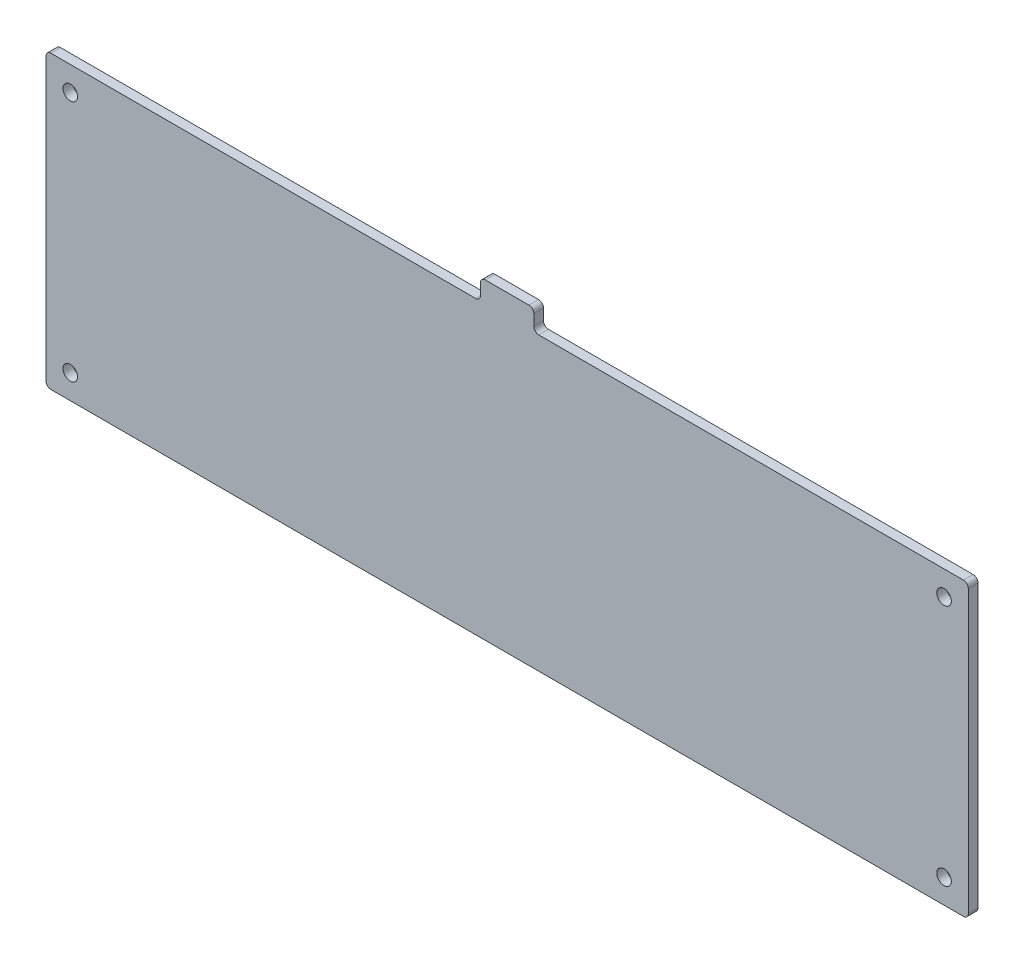
ISO-10303-21;
HEADER;
FILE_DESCRIPTION(('STEP AP214'),'2;1');
FILE_NAME('part.step','',(''),(''),'','','');
FILE_SCHEMA(('AUTOMOTIVE_DESIGN { 1 0 10303 214 1 1 1 1 }'));
ENDSEC;
DATA;
#1=APPLICATION_CONTEXT('core data for automotive mechanical design processes');
#2=APPLICATION_PROTOCOL_DEFINITION('international standard','automotive_design',2000,#1);
#3=PRODUCT_CONTEXT('',#1,'mechanical');
#4=PRODUCT('Part','Part','',(#3));
#5=PRODUCT_RELATED_PRODUCT_CATEGORY('part','',(#4));
#6=PRODUCT_DEFINITION_FORMATION('','',#4);
#7=PRODUCT_DEFINITION_CONTEXT('part definition',#1,'design');
#8=PRODUCT_DEFINITION('design','',#6,#7);
#9=PRODUCT_DEFINITION_SHAPE('','',#8);
#10=(LENGTH_UNIT() NAMED_UNIT(*) SI_UNIT(.MILLI.,.METRE.));
#11=(NAMED_UNIT(*) PLANE_ANGLE_UNIT() SI_UNIT($,.RADIAN.));
#12=(NAMED_UNIT(*) SI_UNIT($,.STERADIAN.) SOLID_ANGLE_UNIT());
#13=UNCERTAINTY_MEASURE_WITH_UNIT(LENGTH_MEASURE(1.E-05),#10,'distance_accuracy_value','');
#14=(GEOMETRIC_REPRESENTATION_CONTEXT(3) GLOBAL_UNCERTAINTY_ASSIGNED_CONTEXT((#13)) GLOBAL_UNIT_ASSIGNED_CONTEXT((#10,
#11,#12)) REPRESENTATION_CONTEXT('',''));
#15=CARTESIAN_POINT('',(0.,0.,0.));
#16=DIRECTION('',(0.,0.,1.));
#17=DIRECTION('',(1.,0.,0.));
#18=AXIS2_PLACEMENT_3D('',#15,#16,#17);
#19=CARTESIAN_POINT('',(0.,0.,2.));
#20=DIRECTION('',(0.,0.,1.));
#21=DIRECTION('',(1.,0.,0.));
#22=AXIS2_PLACEMENT_3D('',#19,#20,#21);
#23=PLANE('',#22);
#24=CARTESIAN_POINT('',(-25.,-8.5,2.));
#25=DIRECTION('',(0.,0.,1.));
#26=DIRECTION('',(-1.,0.,0.));
#27=AXIS2_PLACEMENT_3D('',#24,#25,#26);
#28=CIRCLE('',#27,1.5);
#29=CARTESIAN_POINT('',(-26.5,-8.5,2.));
#30=VERTEX_POINT('',#29);
#31=EDGE_CURVE('E529',#30,#30,#28,.T.);
#32=ORIENTED_EDGE('',*,*,#31,.F.);
#33=EDGE_LOOP('',(#32));
#34=FACE_BOUND('',#33,.T.);
#35=CARTESIAN_POINT('',(-25.,41.5,2.));
#36=DIRECTION('',(0.,0.,1.));
#37=DIRECTION('',(1.,0.,0.));
#38=AXIS2_PLACEMENT_3D('',#35,#36,#37);
#39=CIRCLE('',#38,1.5);
#40=CARTESIAN_POINT('',(-23.5,41.5,2.));
#41=VERTEX_POINT('',#40);
#42=EDGE_CURVE('E182',#41,#41,#39,.T.);
#43=ORIENTED_EDGE('',*,*,#42,.F.);
#44=EDGE_LOOP('',(#43));
#45=FACE_BOUND('',#44,.T.);
#46=DIRECTION('',(-1.,0.,0.));
#47=VECTOR('',#46,1.);
#48=CARTESIAN_POINT('',(59.5,46.5,2.));
#49=LINE('',#48,#47);
#50=CARTESIAN_POINT('',(58.5,46.5,2.));
#51=VERTEX_POINT('',#50);
#52=CARTESIAN_POINT('',(-29.,46.5,2.));
#53=VERTEX_POINT('',#52);
#54=EDGE_CURVE('E199',#51,#53,#49,.T.);
#55=ORIENTED_EDGE('',*,*,#54,.T.);
#56=CARTESIAN_POINT('',(-29.,45.5,2.));
#57=DIRECTION('',(0.,0.,1.));
#58=DIRECTION('',(1.,0.,0.));
#59=AXIS2_PLACEMENT_3D('',#56,#57,#58);
#60=CIRCLE('',#59,1.);
#61=CARTESIAN_POINT('',(-30.,45.5,2.));
#62=VERTEX_POINT('',#61);
#63=EDGE_CURVE('E222',#53,#62,#60,.T.);
#64=ORIENTED_EDGE('',*,*,#63,.T.);
#65=DIRECTION('',(0.,-1.,0.));
#66=VECTOR('',#65,1.);
#67=CARTESIAN_POINT('',(-30.,46.5,2.));
#68=LINE('',#67,#66);
#69=CARTESIAN_POINT('',(-30.,-12.5,2.));
#70=VERTEX_POINT('',#69);
#71=EDGE_CURVE('E169',#62,#70,#68,.T.);
#72=ORIENTED_EDGE('',*,*,#71,.T.);
#73=CARTESIAN_POINT('',(-29.,-12.5,2.));
#74=DIRECTION('',(0.,0.,1.));
#75=DIRECTION('',(1.,0.,0.));
#76=AXIS2_PLACEMENT_3D('',#73,#74,#75);
#77=CIRCLE('',#76,1.);
#78=CARTESIAN_POINT('',(-29.,-13.5,2.));
#79=VERTEX_POINT('',#78);
#80=EDGE_CURVE('E220',#70,#79,#77,.T.);
#81=ORIENTED_EDGE('',*,*,#80,.T.);
#82=DIRECTION('',(1.,0.,0.));
#83=VECTOR('',#82,1.);
#84=CARTESIAN_POINT('',(-30.,-13.5,2.));
#85=LINE('',#84,#83);
#86=CARTESIAN_POINT('',(159.,-13.5,2.));
#87=VERTEX_POINT('',#86);
#88=EDGE_CURVE('E269',#79,#87,#85,.T.);
#89=ORIENTED_EDGE('',*,*,#88,.T.);
#90=CARTESIAN_POINT('',(159.,-12.5,2.));
#91=DIRECTION('',(0.,0.,1.));
#92=DIRECTION('',(1.,0.,0.));
#93=AXIS2_PLACEMENT_3D('',#90,#91,#92);
#94=CIRCLE('',#93,1.);
#95=CARTESIAN_POINT('',(160.,-12.5,2.));
#96=VERTEX_POINT('',#95);
#97=EDGE_CURVE('E218',#87,#96,#94,.T.);
#98=ORIENTED_EDGE('',*,*,#97,.T.);
#99=DIRECTION('',(0.,1.,0.));
#100=VECTOR('',#99,1.);
#101=CARTESIAN_POINT('',(160.,46.5,2.));
#102=LINE('',#101,#100);
#103=CARTESIAN_POINT('',(160.,45.5,2.));
#104=VERTEX_POINT('',#103);
#105=EDGE_CURVE('E277',#96,#104,#102,.T.);
#106=ORIENTED_EDGE('',*,*,#105,.T.);
#107=CARTESIAN_POINT('',(159.,45.5,2.));
#108=DIRECTION('',(0.,0.,1.));
#109=DIRECTION('',(1.,0.,0.));
#110=AXIS2_PLACEMENT_3D('',#107,#108,#109);
#111=CIRCLE('',#110,1.);
#112=CARTESIAN_POINT('',(159.,46.5,2.));
#113=VERTEX_POINT('',#112);
#114=EDGE_CURVE('E216',#104,#113,#111,.T.);
#115=ORIENTED_EDGE('',*,*,#114,.T.);
#116=DIRECTION('',(-1.,0.,0.));
#117=VECTOR('',#116,1.);
#118=CARTESIAN_POINT('',(160.,46.5,2.));
#119=LINE('',#118,#117);
#120=CARTESIAN_POINT('',(71.5,46.5,2.));
#121=VERTEX_POINT('',#120);
#122=EDGE_CURVE('E280',#113,#121,#119,.T.);
#123=ORIENTED_EDGE('',*,*,#122,.T.);
#124=CARTESIAN_POINT('',(71.5,47.5,2.));
#125=DIRECTION('',(0.,0.,1.));
#126=DIRECTION('',(1.,0.,0.));
#127=AXIS2_PLACEMENT_3D('',#124,#125,#126);
#128=CIRCLE('',#127,1.);
#129=CARTESIAN_POINT('',(70.5,47.5,2.));
#130=VERTEX_POINT('',#129);
#131=EDGE_CURVE('E255',#121,#130,#128,.F.);
#132=ORIENTED_EDGE('',*,*,#131,.T.);
#133=DIRECTION('',(0.,1.,0.));
#134=VECTOR('',#133,1.);
#135=CARTESIAN_POINT('',(70.5,50.8,2.));
#136=LINE('',#135,#134);
#137=CARTESIAN_POINT('',(70.5,49.8,2.));
#138=VERTEX_POINT('',#137);
#139=EDGE_CURVE('E283',#130,#138,#136,.T.);
#140=ORIENTED_EDGE('',*,*,#139,.T.);
#141=CARTESIAN_POINT('',(69.5,49.8,2.));
#142=DIRECTION('',(0.,0.,1.));
#143=DIRECTION('',(1.,0.,0.));
#144=AXIS2_PLACEMENT_3D('',#141,#142,#143);
#145=CIRCLE('',#144,1.);
#146=CARTESIAN_POINT('',(69.5,50.8,2.));
#147=VERTEX_POINT('',#146);
#148=EDGE_CURVE('E214',#138,#147,#145,.T.);
#149=ORIENTED_EDGE('',*,*,#148,.T.);
#150=DIRECTION('',(-1.,0.,0.));
#151=VECTOR('',#150,1.);
#152=CARTESIAN_POINT('',(59.5,50.8,2.));
#153=LINE('',#152,#151);
#154=CARTESIAN_POINT('',(60.5,50.8,2.));
#155=VERTEX_POINT('',#154);
#156=EDGE_CURVE('E286',#147,#155,#153,.T.);
#157=ORIENTED_EDGE('',*,*,#156,.T.);
#158=CARTESIAN_POINT('',(60.5,49.8,2.));
#159=DIRECTION('',(0.,0.,1.));
#160=DIRECTION('',(1.,0.,0.));
#161=AXIS2_PLACEMENT_3D('',#158,#159,#160);
#162=CIRCLE('',#161,1.);
#163=CARTESIAN_POINT('',(59.5,49.8,2.));
#164=VERTEX_POINT('',#163);
#165=EDGE_CURVE('E57',#155,#164,#162,.T.);
#166=ORIENTED_EDGE('',*,*,#165,.T.);
#167=DIRECTION('',(0.,-1.,0.));
#168=VECTOR('',#167,1.);
#169=CARTESIAN_POINT('',(59.5,46.5,2.));
#170=LINE('',#169,#168);
#171=CARTESIAN_POINT('',(59.5,47.5,2.));
#172=VERTEX_POINT('',#171);
#173=EDGE_CURVE('E200',#164,#172,#170,.T.);
#174=ORIENTED_EDGE('',*,*,#173,.T.);
#175=CARTESIAN_POINT('',(58.5,47.5,2.));
#176=DIRECTION('',(0.,0.,1.));
#177=DIRECTION('',(1.,0.,0.));
#178=AXIS2_PLACEMENT_3D('',#175,#176,#177);
#179=CIRCLE('',#178,1.);
#180=EDGE_CURVE('E11',#172,#51,#179,.F.);
#181=ORIENTED_EDGE('',*,*,#180,.T.);
#182=EDGE_LOOP('',(#55,#64,#72,#81,#89,#98,#106,#115,#123,#132,#140,#149,#157,#166,#174,#181));
#183=FACE_BOUND('',#182,.T.);
#184=CARTESIAN_POINT('',(155.,41.5,2.));
#185=DIRECTION('',(0.,0.,1.));
#186=DIRECTION('',(-1.,0.,0.));
#187=AXIS2_PLACEMENT_3D('',#184,#185,#186);
#188=CIRCLE('',#187,1.5);
#189=CARTESIAN_POINT('',(153.5,41.5,2.));
#190=VERTEX_POINT('',#189);
#191=EDGE_CURVE('E535',#190,#190,#188,.T.);
#192=ORIENTED_EDGE('',*,*,#191,.F.);
#193=EDGE_LOOP('',(#192));
#194=FACE_BOUND('',#193,.T.);
#195=CARTESIAN_POINT('',(155.,-8.49999999999997,2.));
#196=DIRECTION('',(0.,0.,1.));
#197=DIRECTION('',(1.,0.,0.));
#198=AXIS2_PLACEMENT_3D('',#195,#196,#197);
#199=CIRCLE('',#198,1.5);
#200=CARTESIAN_POINT('',(156.5,-8.49999999999997,2.));
#201=VERTEX_POINT('',#200);
#202=EDGE_CURVE('E520',#201,#201,#199,.T.);
#203=ORIENTED_EDGE('',*,*,#202,.F.);
#204=EDGE_LOOP('',(#203));
#205=FACE_BOUND('',#204,.T.);
#206=ADVANCED_FACE('F35',(#34,#45,#183,#194,#205),#23,.T.);
#207=CARTESIAN_POINT('',(0.,0.,0.));
#208=DIRECTION('',(0.,0.,1.));
#209=DIRECTION('',(1.,0.,0.));
#210=AXIS2_PLACEMENT_3D('',#207,#208,#209);
#211=PLANE('',#210);
#212=DIRECTION('',(0.,-1.,0.));
#213=VECTOR('',#212,1.);
#214=CARTESIAN_POINT('',(-30.,46.5,0.));
#215=LINE('',#214,#213);
#216=CARTESIAN_POINT('',(-30.,45.5,0.));
#217=VERTEX_POINT('',#216);
#218=CARTESIAN_POINT('',(-30.,-12.5,0.));
#219=VERTEX_POINT('',#218);
#220=EDGE_CURVE('E166',#217,#219,#215,.T.);
#221=ORIENTED_EDGE('',*,*,#220,.F.);
#222=CARTESIAN_POINT('',(-29.,45.5,0.));
#223=DIRECTION('',(0.,0.,1.));
#224=DIRECTION('',(1.,0.,0.));
#225=AXIS2_PLACEMENT_3D('',#222,#223,#224);
#226=CIRCLE('',#225,1.);
#227=CARTESIAN_POINT('',(-29.,46.5,0.));
#228=VERTEX_POINT('',#227);
#229=EDGE_CURVE('E149',#217,#228,#226,.F.);
#230=ORIENTED_EDGE('',*,*,#229,.T.);
#231=DIRECTION('',(-1.,0.,0.));
#232=VECTOR('',#231,1.);
#233=CARTESIAN_POINT('',(59.5,46.5,0.));
#234=LINE('',#233,#232);
#235=CARTESIAN_POINT('',(58.5,46.5,0.));
#236=VERTEX_POINT('',#235);
#237=EDGE_CURVE('E177',#236,#228,#234,.T.);
#238=ORIENTED_EDGE('',*,*,#237,.F.);
#239=CARTESIAN_POINT('',(58.5,47.5,0.));
#240=DIRECTION('',(0.,0.,1.));
#241=DIRECTION('',(1.,0.,0.));
#242=AXIS2_PLACEMENT_3D('',#239,#240,#241);
#243=CIRCLE('',#242,1.);
#244=CARTESIAN_POINT('',(59.5,47.5,0.));
#245=VERTEX_POINT('',#244);
#246=EDGE_CURVE('E43',#236,#245,#243,.T.);
#247=ORIENTED_EDGE('',*,*,#246,.T.);
#248=DIRECTION('',(0.,-1.,0.));
#249=VECTOR('',#248,1.);
#250=CARTESIAN_POINT('',(59.5,46.5,0.));
#251=LINE('',#250,#249);
#252=CARTESIAN_POINT('',(59.5,49.8,0.));
#253=VERTEX_POINT('',#252);
#254=EDGE_CURVE('E197',#253,#245,#251,.T.);
#255=ORIENTED_EDGE('',*,*,#254,.F.);
#256=CARTESIAN_POINT('',(60.5,49.8,0.));
#257=DIRECTION('',(0.,0.,1.));
#258=DIRECTION('',(1.,0.,0.));
#259=AXIS2_PLACEMENT_3D('',#256,#257,#258);
#260=CIRCLE('',#259,1.);
#261=CARTESIAN_POINT('',(60.5,50.8,0.));
#262=VERTEX_POINT('',#261);
#263=EDGE_CURVE('E170',#253,#262,#260,.F.);
#264=ORIENTED_EDGE('',*,*,#263,.T.);
#265=DIRECTION('',(-1.,0.,0.));
#266=VECTOR('',#265,1.);
#267=CARTESIAN_POINT('',(59.5,50.8,0.));
#268=LINE('',#267,#266);
#269=CARTESIAN_POINT('',(69.5,50.8,0.));
#270=VERTEX_POINT('',#269);
#271=EDGE_CURVE('E194',#270,#262,#268,.T.);
#272=ORIENTED_EDGE('',*,*,#271,.F.);
#273=CARTESIAN_POINT('',(69.5,49.8,0.));
#274=DIRECTION('',(0.,0.,1.));
#275=DIRECTION('',(1.,0.,0.));
#276=AXIS2_PLACEMENT_3D('',#273,#274,#275);
#277=CIRCLE('',#276,1.);
#278=CARTESIAN_POINT('',(70.5,49.8,0.));
#279=VERTEX_POINT('',#278);
#280=EDGE_CURVE('E203',#270,#279,#277,.F.);
#281=ORIENTED_EDGE('',*,*,#280,.T.);
#282=DIRECTION('',(0.,1.,0.));
#283=VECTOR('',#282,1.);
#284=CARTESIAN_POINT('',(70.5,50.8,0.));
#285=LINE('',#284,#283);
#286=CARTESIAN_POINT('',(70.5,47.5,0.));
#287=VERTEX_POINT('',#286);
#288=EDGE_CURVE('E191',#287,#279,#285,.T.);
#289=ORIENTED_EDGE('',*,*,#288,.F.);
#290=CARTESIAN_POINT('',(71.5,47.5,0.));
#291=DIRECTION('',(0.,0.,1.));
#292=DIRECTION('',(1.,0.,0.));
#293=AXIS2_PLACEMENT_3D('',#290,#291,#292);
#294=CIRCLE('',#293,1.);
#295=CARTESIAN_POINT('',(71.5,46.5,0.));
#296=VERTEX_POINT('',#295);
#297=EDGE_CURVE('E253',#287,#296,#294,.T.);
#298=ORIENTED_EDGE('',*,*,#297,.T.);
#299=DIRECTION('',(-1.,0.,0.));
#300=VECTOR('',#299,1.);
#301=CARTESIAN_POINT('',(160.,46.5,0.));
#302=LINE('',#301,#300);
#303=CARTESIAN_POINT('',(159.,46.5,0.));
#304=VERTEX_POINT('',#303);
#305=EDGE_CURVE('E188',#304,#296,#302,.T.);
#306=ORIENTED_EDGE('',*,*,#305,.F.);
#307=CARTESIAN_POINT('',(159.,45.5,0.));
#308=DIRECTION('',(0.,0.,1.));
#309=DIRECTION('',(1.,0.,0.));
#310=AXIS2_PLACEMENT_3D('',#307,#308,#309);
#311=CIRCLE('',#310,1.);
#312=CARTESIAN_POINT('',(160.,45.5,0.));
#313=VERTEX_POINT('',#312);
#314=EDGE_CURVE('E205',#304,#313,#311,.F.);
#315=ORIENTED_EDGE('',*,*,#314,.T.);
#316=DIRECTION('',(0.,1.,0.));
#317=VECTOR('',#316,1.);
#318=CARTESIAN_POINT('',(160.,46.5,0.));
#319=LINE('',#318,#317);
#320=CARTESIAN_POINT('',(160.,-12.5,0.));
#321=VERTEX_POINT('',#320);
#322=EDGE_CURVE('E180',#321,#313,#319,.T.);
#323=ORIENTED_EDGE('',*,*,#322,.F.);
#324=CARTESIAN_POINT('',(159.,-12.5,0.));
#325=DIRECTION('',(0.,0.,1.));
#326=DIRECTION('',(1.,0.,0.));
#327=AXIS2_PLACEMENT_3D('',#324,#325,#326);
#328=CIRCLE('',#327,1.);
#329=CARTESIAN_POINT('',(159.,-13.5,0.));
#330=VERTEX_POINT('',#329);
#331=EDGE_CURVE('E207',#321,#330,#328,.F.);
#332=ORIENTED_EDGE('',*,*,#331,.T.);
#333=DIRECTION('',(1.,0.,0.));
#334=VECTOR('',#333,1.);
#335=CARTESIAN_POINT('',(-30.,-13.5,0.));
#336=LINE('',#335,#334);
#337=CARTESIAN_POINT('',(-29.,-13.5,0.));
#338=VERTEX_POINT('',#337);
#339=EDGE_CURVE('E176',#338,#330,#336,.T.);
#340=ORIENTED_EDGE('',*,*,#339,.F.);
#341=CARTESIAN_POINT('',(-29.,-12.5,0.));
#342=DIRECTION('',(0.,0.,1.));
#343=DIRECTION('',(1.,0.,0.));
#344=AXIS2_PLACEMENT_3D('',#341,#342,#343);
#345=CIRCLE('',#344,1.);
#346=EDGE_CURVE('E160',#338,#219,#345,.F.);
#347=ORIENTED_EDGE('',*,*,#346,.T.);
#348=EDGE_LOOP('',(#221,#230,#238,#247,#255,#264,#272,#281,#289,#298,#306,#315,#323,#332,#340,#347));
#349=FACE_BOUND('',#348,.T.);
#350=CARTESIAN_POINT('',(-25.,41.5,0.));
#351=DIRECTION('',(0.,0.,1.));
#352=DIRECTION('',(1.,0.,0.));
#353=AXIS2_PLACEMENT_3D('',#350,#351,#352);
#354=CIRCLE('',#353,1.5);
#355=CARTESIAN_POINT('',(-23.5,41.5,0.));
#356=VERTEX_POINT('',#355);
#357=EDGE_CURVE('E272',#356,#356,#354,.T.);
#358=ORIENTED_EDGE('',*,*,#357,.T.);
#359=EDGE_LOOP('',(#358));
#360=FACE_BOUND('',#359,.T.);
#361=CARTESIAN_POINT('',(155.,41.5,0.));
#362=DIRECTION('',(0.,0.,1.));
#363=DIRECTION('',(-1.,0.,0.));
#364=AXIS2_PLACEMENT_3D('',#361,#362,#363);
#365=CIRCLE('',#364,1.5);
#366=CARTESIAN_POINT('',(153.5,41.5,0.));
#367=VERTEX_POINT('',#366);
#368=EDGE_CURVE('E532',#367,#367,#365,.T.);
#369=ORIENTED_EDGE('',*,*,#368,.T.);
#370=EDGE_LOOP('',(#369));
#371=FACE_BOUND('',#370,.T.);
#372=CARTESIAN_POINT('',(-25.,-8.5,0.));
#373=DIRECTION('',(0.,0.,1.));
#374=DIRECTION('',(-1.,0.,0.));
#375=AXIS2_PLACEMENT_3D('',#372,#373,#374);
#376=CIRCLE('',#375,1.5);
#377=CARTESIAN_POINT('',(-26.5,-8.5,0.));
#378=VERTEX_POINT('',#377);
#379=EDGE_CURVE('E526',#378,#378,#376,.T.);
#380=ORIENTED_EDGE('',*,*,#379,.T.);
#381=EDGE_LOOP('',(#380));
#382=FACE_BOUND('',#381,.T.);
#383=CARTESIAN_POINT('',(155.,-8.49999999999997,0.));
#384=DIRECTION('',(0.,0.,1.));
#385=DIRECTION('',(1.,0.,0.));
#386=AXIS2_PLACEMENT_3D('',#383,#384,#385);
#387=CIRCLE('',#386,1.5);
#388=CARTESIAN_POINT('',(156.5,-8.49999999999997,0.));
#389=VERTEX_POINT('',#388);
#390=EDGE_CURVE('E523',#389,#389,#387,.T.);
#391=ORIENTED_EDGE('',*,*,#390,.T.);
#392=EDGE_LOOP('',(#391));
#393=FACE_BOUND('',#392,.T.);
#394=ADVANCED_FACE('F173',(#349,#360,#371,#382,#393),#211,.F.);
#395=CARTESIAN_POINT('',(59.5,46.5,2.));
#396=DIRECTION('',(0.,-1.,0.));
#397=DIRECTION('',(1.,0.,0.));
#398=AXIS2_PLACEMENT_3D('',#395,#396,#397);
#399=PLANE('',#398);
#400=ORIENTED_EDGE('',*,*,#237,.T.);
#401=DIRECTION('',(0.,0.,-1.));
#402=VECTOR('',#401,1.);
#403=CARTESIAN_POINT('',(-29.,46.5,2.));
#404=LINE('',#403,#402);
#405=EDGE_CURVE('E154',#228,#53,#404,.F.);
#406=ORIENTED_EDGE('',*,*,#405,.T.);
#407=ORIENTED_EDGE('',*,*,#54,.F.);
#408=DIRECTION('',(0.,0.,-1.));
#409=VECTOR('',#408,1.);
#410=CARTESIAN_POINT('',(58.5,46.5,0.));
#411=LINE('',#410,#409);
#412=EDGE_CURVE('E159',#51,#236,#411,.T.);
#413=ORIENTED_EDGE('',*,*,#412,.T.);
#414=EDGE_LOOP('',(#400,#406,#407,#413));
#415=FACE_BOUND('',#414,.T.);
#416=ADVANCED_FACE('F267',(#415),#399,.F.);
#417=CARTESIAN_POINT('',(-30.,46.5,2.));
#418=DIRECTION('',(1.,0.,0.));
#419=DIRECTION('',(0.,1.,0.));
#420=AXIS2_PLACEMENT_3D('',#417,#418,#419);
#421=PLANE('',#420);
#422=ORIENTED_EDGE('',*,*,#71,.F.);
#423=DIRECTION('',(0.,0.,-1.));
#424=VECTOR('',#423,1.);
#425=CARTESIAN_POINT('',(-30.,45.5,2.));
#426=LINE('',#425,#424);
#427=EDGE_CURVE('E153',#62,#217,#426,.T.);
#428=ORIENTED_EDGE('',*,*,#427,.T.);
#429=ORIENTED_EDGE('',*,*,#220,.T.);
#430=DIRECTION('',(0.,0.,-1.));
#431=VECTOR('',#430,1.);
#432=CARTESIAN_POINT('',(-30.,-12.5,2.));
#433=LINE('',#432,#431);
#434=EDGE_CURVE('E171',#219,#70,#433,.F.);
#435=ORIENTED_EDGE('',*,*,#434,.T.);
#436=EDGE_LOOP('',(#422,#428,#429,#435));
#437=FACE_BOUND('',#436,.T.);
#438=ADVANCED_FACE('F165',(#437),#421,.F.);
#439=CARTESIAN_POINT('',(-30.,-13.5,2.));
#440=DIRECTION('',(0.,1.,0.));
#441=DIRECTION('',(-1.,0.,0.));
#442=AXIS2_PLACEMENT_3D('',#439,#440,#441);
#443=PLANE('',#442);
#444=ORIENTED_EDGE('',*,*,#88,.F.);
#445=DIRECTION('',(0.,0.,-1.));
#446=VECTOR('',#445,1.);
#447=CARTESIAN_POINT('',(-29.,-13.5,2.));
#448=LINE('',#447,#446);
#449=EDGE_CURVE('E226',#79,#338,#448,.T.);
#450=ORIENTED_EDGE('',*,*,#449,.T.);
#451=ORIENTED_EDGE('',*,*,#339,.T.);
#452=DIRECTION('',(0.,0.,-1.));
#453=VECTOR('',#452,1.);
#454=CARTESIAN_POINT('',(159.,-13.5,2.));
#455=LINE('',#454,#453);
#456=EDGE_CURVE('E224',#330,#87,#455,.F.);
#457=ORIENTED_EDGE('',*,*,#456,.T.);
#458=EDGE_LOOP('',(#444,#450,#451,#457));
#459=FACE_BOUND('',#458,.T.);
#460=ADVANCED_FACE('F327',(#459),#443,.F.);
#461=CARTESIAN_POINT('',(160.,46.5,2.));
#462=DIRECTION('',(-1.,0.,0.));
#463=DIRECTION('',(0.,0.,1.));
#464=AXIS2_PLACEMENT_3D('',#461,#462,#463);
#465=PLANE('',#464);
#466=ORIENTED_EDGE('',*,*,#105,.F.);
#467=DIRECTION('',(0.,0.,-1.));
#468=VECTOR('',#467,1.);
#469=CARTESIAN_POINT('',(160.,-12.5,2.));
#470=LINE('',#469,#468);
#471=EDGE_CURVE('E231',#96,#321,#470,.T.);
#472=ORIENTED_EDGE('',*,*,#471,.T.);
#473=ORIENTED_EDGE('',*,*,#322,.T.);
#474=DIRECTION('',(0.,0.,-1.));
#475=VECTOR('',#474,1.);
#476=CARTESIAN_POINT('',(160.,45.5,2.));
#477=LINE('',#476,#475);
#478=EDGE_CURVE('E229',#313,#104,#477,.F.);
#479=ORIENTED_EDGE('',*,*,#478,.T.);
#480=EDGE_LOOP('',(#466,#472,#473,#479));
#481=FACE_BOUND('',#480,.T.);
#482=ADVANCED_FACE('F319',(#481),#465,.F.);
#483=CARTESIAN_POINT('',(160.,46.5,2.));
#484=DIRECTION('',(0.,-1.,0.));
#485=DIRECTION('',(0.,0.,-1.));
#486=AXIS2_PLACEMENT_3D('',#483,#484,#485);
#487=PLANE('',#486);
#488=ORIENTED_EDGE('',*,*,#122,.F.);
#489=DIRECTION('',(0.,0.,-1.));
#490=VECTOR('',#489,1.);
#491=CARTESIAN_POINT('',(159.,46.5,2.));
#492=LINE('',#491,#490);
#493=EDGE_CURVE('E236',#113,#304,#492,.T.);
#494=ORIENTED_EDGE('',*,*,#493,.T.);
#495=ORIENTED_EDGE('',*,*,#305,.T.);
#496=DIRECTION('',(0.,0.,-1.));
#497=VECTOR('',#496,1.);
#498=CARTESIAN_POINT('',(71.5,46.5,2.));
#499=LINE('',#498,#497);
#500=EDGE_CURVE('E234',#296,#121,#499,.F.);
#501=ORIENTED_EDGE('',*,*,#500,.T.);
#502=EDGE_LOOP('',(#488,#494,#495,#501));
#503=FACE_BOUND('',#502,.T.);
#504=ADVANCED_FACE('F310',(#503),#487,.F.);
#505=CARTESIAN_POINT('',(70.5,50.8,2.));
#506=DIRECTION('',(-1.,0.,0.));
#507=DIRECTION('',(0.,0.,1.));
#508=AXIS2_PLACEMENT_3D('',#505,#506,#507);
#509=PLANE('',#508);
#510=ORIENTED_EDGE('',*,*,#139,.F.);
#511=DIRECTION('',(0.,0.,-1.));
#512=VECTOR('',#511,1.);
#513=CARTESIAN_POINT('',(70.5,47.5,0.));
#514=LINE('',#513,#512);
#515=EDGE_CURVE('E241',#130,#287,#514,.T.);
#516=ORIENTED_EDGE('',*,*,#515,.T.);
#517=ORIENTED_EDGE('',*,*,#288,.T.);
#518=DIRECTION('',(0.,0.,-1.));
#519=VECTOR('',#518,1.);
#520=CARTESIAN_POINT('',(70.5,49.8,2.));
#521=LINE('',#520,#519);
#522=EDGE_CURVE('E239',#279,#138,#521,.F.);
#523=ORIENTED_EDGE('',*,*,#522,.T.);
#524=EDGE_LOOP('',(#510,#516,#517,#523));
#525=FACE_BOUND('',#524,.T.);
#526=ADVANCED_FACE('F301',(#525),#509,.F.);
#527=CARTESIAN_POINT('',(59.5,50.8,2.));
#528=DIRECTION('',(0.,-1.,0.));
#529=DIRECTION('',(0.,0.,-1.));
#530=AXIS2_PLACEMENT_3D('',#527,#528,#529);
#531=PLANE('',#530);
#532=ORIENTED_EDGE('',*,*,#156,.F.);
#533=DIRECTION('',(0.,0.,-1.));
#534=VECTOR('',#533,1.);
#535=CARTESIAN_POINT('',(69.5,50.8,2.));
#536=LINE('',#535,#534);
#537=EDGE_CURVE('E250',#147,#270,#536,.T.);
#538=ORIENTED_EDGE('',*,*,#537,.T.);
#539=ORIENTED_EDGE('',*,*,#271,.T.);
#540=DIRECTION('',(0.,0.,-1.));
#541=VECTOR('',#540,1.);
#542=CARTESIAN_POINT('',(60.5,50.8,2.));
#543=LINE('',#542,#541);
#544=EDGE_CURVE('E248',#262,#155,#543,.F.);
#545=ORIENTED_EDGE('',*,*,#544,.T.);
#546=EDGE_LOOP('',(#532,#538,#539,#545));
#547=FACE_BOUND('',#546,.T.);
#548=ADVANCED_FACE('F294',(#547),#531,.F.);
#549=CARTESIAN_POINT('',(59.5,46.5,2.));
#550=DIRECTION('',(1.,0.,0.));
#551=DIRECTION('',(0.,0.,-1.));
#552=AXIS2_PLACEMENT_3D('',#549,#550,#551);
#553=PLANE('',#552);
#554=ORIENTED_EDGE('',*,*,#254,.T.);
#555=DIRECTION('',(0.,0.,-1.));
#556=VECTOR('',#555,1.);
#557=CARTESIAN_POINT('',(59.5,47.5,2.));
#558=LINE('',#557,#556);
#559=EDGE_CURVE('E50',#245,#172,#558,.F.);
#560=ORIENTED_EDGE('',*,*,#559,.T.);
#561=ORIENTED_EDGE('',*,*,#173,.F.);
#562=DIRECTION('',(0.,0.,-1.));
#563=VECTOR('',#562,1.);
#564=CARTESIAN_POINT('',(59.5,49.8,2.));
#565=LINE('',#564,#563);
#566=EDGE_CURVE('E244',#164,#253,#565,.T.);
#567=ORIENTED_EDGE('',*,*,#566,.T.);
#568=EDGE_LOOP('',(#554,#560,#561,#567));
#569=FACE_BOUND('',#568,.T.);
#570=ADVANCED_FACE('F259',(#569),#553,.F.);
#571=CARTESIAN_POINT('',(-25.,41.5,2.));
#572=DIRECTION('',(0.,0.,-1.));
#573=DIRECTION('',(-1.,0.,0.));
#574=AXIS2_PLACEMENT_3D('',#571,#572,#573);
#575=CYLINDRICAL_SURFACE('',#574,1.5);
#576=ORIENTED_EDGE('',*,*,#42,.T.);
#577=EDGE_LOOP('',(#576));
#578=FACE_BOUND('',#577,.T.);
#579=ORIENTED_EDGE('',*,*,#357,.F.);
#580=EDGE_LOOP('',(#579));
#581=FACE_BOUND('',#580,.T.);
#582=ADVANCED_FACE('F351',(#578,#581),#575,.F.);
#583=CARTESIAN_POINT('',(155.,41.5,2.));
#584=DIRECTION('',(0.,0.,-1.));
#585=DIRECTION('',(-1.,0.,0.));
#586=AXIS2_PLACEMENT_3D('',#583,#584,#585);
#587=CYLINDRICAL_SURFACE('',#586,1.5);
#588=ORIENTED_EDGE('',*,*,#191,.T.);
#589=EDGE_LOOP('',(#588));
#590=FACE_BOUND('',#589,.T.);
#591=ORIENTED_EDGE('',*,*,#368,.F.);
#592=EDGE_LOOP('',(#591));
#593=FACE_BOUND('',#592,.T.);
#594=ADVANCED_FACE('F408',(#590,#593),#587,.F.);
#595=CARTESIAN_POINT('',(-25.,-8.5,2.));
#596=DIRECTION('',(0.,0.,-1.));
#597=DIRECTION('',(-1.,0.,0.));
#598=AXIS2_PLACEMENT_3D('',#595,#596,#597);
#599=CYLINDRICAL_SURFACE('',#598,1.5);
#600=ORIENTED_EDGE('',*,*,#31,.T.);
#601=EDGE_LOOP('',(#600));
#602=FACE_BOUND('',#601,.T.);
#603=ORIENTED_EDGE('',*,*,#379,.F.);
#604=EDGE_LOOP('',(#603));
#605=FACE_BOUND('',#604,.T.);
#606=ADVANCED_FACE('F415',(#602,#605),#599,.F.);
#607=CARTESIAN_POINT('',(155.,-8.49999999999997,2.));
#608=DIRECTION('',(0.,0.,-1.));
#609=DIRECTION('',(-1.,0.,0.));
#610=AXIS2_PLACEMENT_3D('',#607,#608,#609);
#611=CYLINDRICAL_SURFACE('',#610,1.5);
#612=ORIENTED_EDGE('',*,*,#202,.T.);
#613=EDGE_LOOP('',(#612));
#614=FACE_BOUND('',#613,.T.);
#615=ORIENTED_EDGE('',*,*,#390,.F.);
#616=EDGE_LOOP('',(#615));
#617=FACE_BOUND('',#616,.T.);
#618=ADVANCED_FACE('F339',(#614,#617),#611,.F.);
#619=CARTESIAN_POINT('',(-29.,45.5,2.));
#620=DIRECTION('',(0.,0.,-1.));
#621=DIRECTION('',(-1.,0.,0.));
#622=AXIS2_PLACEMENT_3D('',#619,#620,#621);
#623=CYLINDRICAL_SURFACE('',#622,1.);
#624=ORIENTED_EDGE('',*,*,#63,.F.);
#625=ORIENTED_EDGE('',*,*,#405,.F.);
#626=ORIENTED_EDGE('',*,*,#229,.F.);
#627=ORIENTED_EDGE('',*,*,#427,.F.);
#628=EDGE_LOOP('',(#624,#625,#626,#627));
#629=FACE_BOUND('',#628,.T.);
#630=ADVANCED_FACE('F152',(#629),#623,.T.);
#631=CARTESIAN_POINT('',(-29.,-12.5,2.));
#632=DIRECTION('',(0.,0.,-1.));
#633=DIRECTION('',(-1.,0.,0.));
#634=AXIS2_PLACEMENT_3D('',#631,#632,#633);
#635=CYLINDRICAL_SURFACE('',#634,1.);
#636=ORIENTED_EDGE('',*,*,#80,.F.);
#637=ORIENTED_EDGE('',*,*,#434,.F.);
#638=ORIENTED_EDGE('',*,*,#346,.F.);
#639=ORIENTED_EDGE('',*,*,#449,.F.);
#640=EDGE_LOOP('',(#636,#637,#638,#639));
#641=FACE_BOUND('',#640,.T.);
#642=ADVANCED_FACE('F331',(#641),#635,.T.);
#643=CARTESIAN_POINT('',(159.,-12.5,2.));
#644=DIRECTION('',(0.,0.,-1.));
#645=DIRECTION('',(-1.,0.,0.));
#646=AXIS2_PLACEMENT_3D('',#643,#644,#645);
#647=CYLINDRICAL_SURFACE('',#646,1.);
#648=ORIENTED_EDGE('',*,*,#97,.F.);
#649=ORIENTED_EDGE('',*,*,#456,.F.);
#650=ORIENTED_EDGE('',*,*,#331,.F.);
#651=ORIENTED_EDGE('',*,*,#471,.F.);
#652=EDGE_LOOP('',(#648,#649,#650,#651));
#653=FACE_BOUND('',#652,.T.);
#654=ADVANCED_FACE('F323',(#653),#647,.T.);
#655=CARTESIAN_POINT('',(159.,45.5,2.));
#656=DIRECTION('',(0.,0.,-1.));
#657=DIRECTION('',(-1.,0.,0.));
#658=AXIS2_PLACEMENT_3D('',#655,#656,#657);
#659=CYLINDRICAL_SURFACE('',#658,1.);
#660=ORIENTED_EDGE('',*,*,#114,.F.);
#661=ORIENTED_EDGE('',*,*,#478,.F.);
#662=ORIENTED_EDGE('',*,*,#314,.F.);
#663=ORIENTED_EDGE('',*,*,#493,.F.);
#664=EDGE_LOOP('',(#660,#661,#662,#663));
#665=FACE_BOUND('',#664,.T.);
#666=ADVANCED_FACE('F314',(#665),#659,.T.);
#667=CARTESIAN_POINT('',(71.5,47.5,2.));
#668=DIRECTION('',(0.,0.,1.));
#669=DIRECTION('',(1.,0.,0.));
#670=AXIS2_PLACEMENT_3D('',#667,#668,#669);
#671=CYLINDRICAL_SURFACE('',#670,1.);
#672=ORIENTED_EDGE('',*,*,#131,.F.);
#673=ORIENTED_EDGE('',*,*,#500,.F.);
#674=ORIENTED_EDGE('',*,*,#297,.F.);
#675=ORIENTED_EDGE('',*,*,#515,.F.);
#676=EDGE_LOOP('',(#672,#673,#674,#675));
#677=FACE_BOUND('',#676,.T.);
#678=ADVANCED_FACE('F305',(#677),#671,.F.);
#679=CARTESIAN_POINT('',(58.5,47.5,2.));
#680=DIRECTION('',(0.,0.,1.));
#681=DIRECTION('',(1.,0.,0.));
#682=AXIS2_PLACEMENT_3D('',#679,#680,#681);
#683=CYLINDRICAL_SURFACE('',#682,1.);
#684=ORIENTED_EDGE('',*,*,#180,.F.);
#685=ORIENTED_EDGE('',*,*,#559,.F.);
#686=ORIENTED_EDGE('',*,*,#246,.F.);
#687=ORIENTED_EDGE('',*,*,#412,.F.);
#688=EDGE_LOOP('',(#684,#685,#686,#687));
#689=FACE_BOUND('',#688,.T.);
#690=ADVANCED_FACE('F262',(#689),#683,.F.);
#691=CARTESIAN_POINT('',(69.5,49.8,2.));
#692=DIRECTION('',(0.,0.,-1.));
#693=DIRECTION('',(-1.,0.,0.));
#694=AXIS2_PLACEMENT_3D('',#691,#692,#693);
#695=CYLINDRICAL_SURFACE('',#694,1.);
#696=ORIENTED_EDGE('',*,*,#148,.F.);
#697=ORIENTED_EDGE('',*,*,#522,.F.);
#698=ORIENTED_EDGE('',*,*,#280,.F.);
#699=ORIENTED_EDGE('',*,*,#537,.F.);
#700=EDGE_LOOP('',(#696,#697,#698,#699));
#701=FACE_BOUND('',#700,.T.);
#702=ADVANCED_FACE('F296',(#701),#695,.T.);
#703=CARTESIAN_POINT('',(60.5,49.8,2.));
#704=DIRECTION('',(0.,0.,-1.));
#705=DIRECTION('',(-1.,0.,0.));
#706=AXIS2_PLACEMENT_3D('',#703,#704,#705);
#707=CYLINDRICAL_SURFACE('',#706,1.);
#708=ORIENTED_EDGE('',*,*,#165,.F.);
#709=ORIENTED_EDGE('',*,*,#544,.F.);
#710=ORIENTED_EDGE('',*,*,#263,.F.);
#711=ORIENTED_EDGE('',*,*,#566,.F.);
#712=EDGE_LOOP('',(#708,#709,#710,#711));
#713=FACE_BOUND('',#712,.T.);
#714=ADVANCED_FACE('F37',(#713),#707,.T.);
#715=CLOSED_SHELL('',(#206,#394,#416,#438,#460,#482,#504,#526,#548,#570,#582,#594,#606,#618,
#630,#642,#654,#666,#678,#690,#702,#714));
#716=MANIFOLD_SOLID_BREP('B2',#715);
#717=ADVANCED_BREP_SHAPE_REPRESENTATION('',(#18,#716),#14);
#718=SHAPE_DEFINITION_REPRESENTATION(#9,#717);
ENDSEC;
END-ISO-10303-21;
